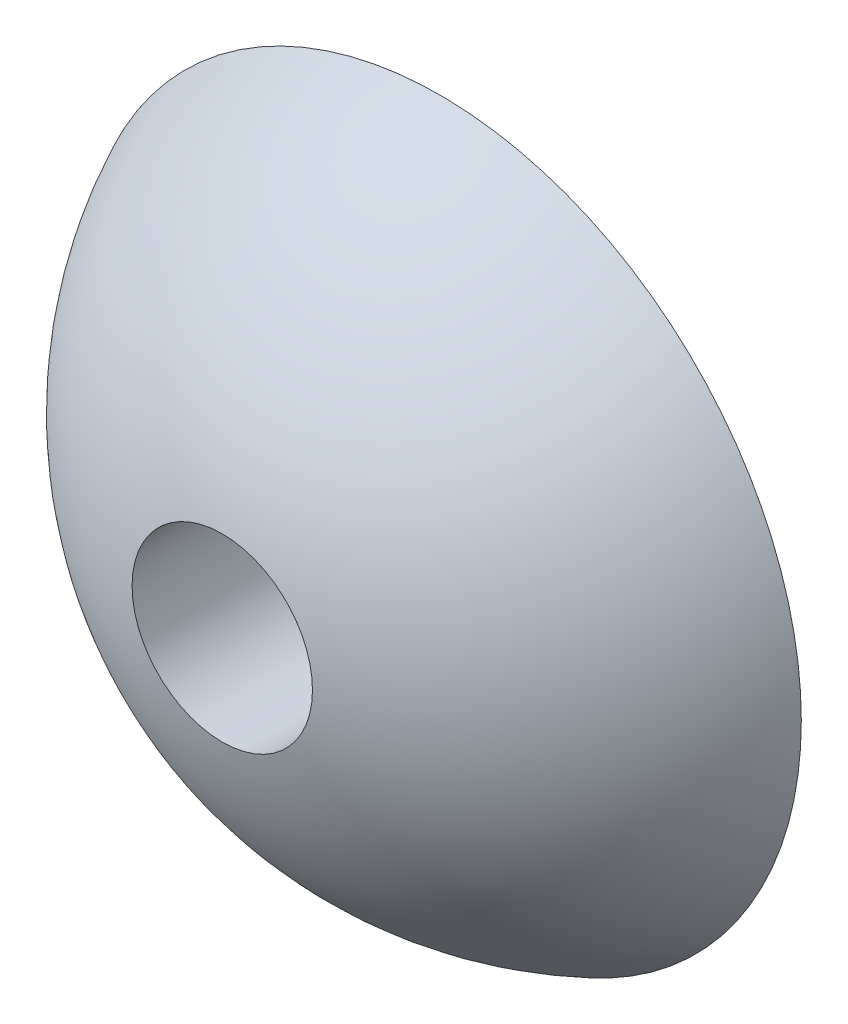
ISO-10303-21;
HEADER;
FILE_DESCRIPTION(('STEP AP214'),'2;1');
FILE_NAME('part.step','',(''),(''),'','','');
FILE_SCHEMA(('AUTOMOTIVE_DESIGN { 1 0 10303 214 1 1 1 1 }'));
ENDSEC;
DATA;
#1=APPLICATION_CONTEXT('core data for automotive mechanical design processes');
#2=APPLICATION_PROTOCOL_DEFINITION('international standard','automotive_design',2000,#1);
#3=PRODUCT_CONTEXT('',#1,'mechanical');
#4=PRODUCT('Part','Part','',(#3));
#5=PRODUCT_RELATED_PRODUCT_CATEGORY('part','',(#4));
#6=PRODUCT_DEFINITION_FORMATION('','',#4);
#7=PRODUCT_DEFINITION_CONTEXT('part definition',#1,'design');
#8=PRODUCT_DEFINITION('design','',#6,#7);
#9=PRODUCT_DEFINITION_SHAPE('','',#8);
#10=(LENGTH_UNIT() NAMED_UNIT(*) SI_UNIT(.MILLI.,.METRE.));
#11=(NAMED_UNIT(*) PLANE_ANGLE_UNIT() SI_UNIT($,.RADIAN.));
#12=(NAMED_UNIT(*) SI_UNIT($,.STERADIAN.) SOLID_ANGLE_UNIT());
#13=UNCERTAINTY_MEASURE_WITH_UNIT(LENGTH_MEASURE(1.E-05),#10,'distance_accuracy_value','');
#14=(GEOMETRIC_REPRESENTATION_CONTEXT(3) GLOBAL_UNCERTAINTY_ASSIGNED_CONTEXT((#13)) GLOBAL_UNIT_ASSIGNED_CONTEXT((#10,
#11,#12)) REPRESENTATION_CONTEXT('',''));
#15=CARTESIAN_POINT('',(0.,0.,0.));
#16=DIRECTION('',(0.,0.,1.));
#17=DIRECTION('',(1.,0.,0.));
#18=AXIS2_PLACEMENT_3D('',#15,#16,#17);
#19=CARTESIAN_POINT('',(35.,-7.,15.));
#20=DIRECTION('',(0.,0.,1.));
#21=DIRECTION('',(1.,0.,0.));
#22=AXIS2_PLACEMENT_3D('',#19,#20,#21);
#23=PLANE('',#22);
#24=CARTESIAN_POINT('',(35.,0.,15.));
#25=DIRECTION('',(0.,0.,1.));
#26=DIRECTION('',(1.,0.,0.));
#27=AXIS2_PLACEMENT_3D('',#24,#25,#26);
#28=CIRCLE('',#27,7.9);
#29=CARTESIAN_POINT('',(42.9,0.,15.));
#30=VERTEX_POINT('',#29);
#31=EDGE_CURVE('E41',#30,#30,#28,.T.);
#32=ORIENTED_EDGE('',*,*,#31,.T.);
#33=EDGE_LOOP('',(#32));
#34=FACE_BOUND('',#33,.T.);
#35=CARTESIAN_POINT('',(35.,0.,15.));
#36=DIRECTION('',(0.,0.,1.));
#37=DIRECTION('',(1.,0.,0.));
#38=AXIS2_PLACEMENT_3D('',#35,#36,#37);
#39=CIRCLE('',#38,31.6227766016838);
#40=CARTESIAN_POINT('',(66.6227766016838,0.,15.));
#41=VERTEX_POINT('',#40);
#42=EDGE_CURVE('E37',#41,#41,#39,.T.);
#43=ORIENTED_EDGE('',*,*,#42,.F.);
#44=EDGE_LOOP('',(#43));
#45=FACE_BOUND('',#44,.T.);
#46=ADVANCED_FACE('F33',(#34,#45),#23,.F.);
#47=CARTESIAN_POINT('',(35.,0.,15.));
#48=DIRECTION('',(0.,0.,1.));
#49=DIRECTION('',(1.,0.,0.));
#50=AXIS2_PLACEMENT_3D('',#47,#48,#49);
#51=CYLINDRICAL_SURFACE('',#50,7.9);
#52=ORIENTED_EDGE('',*,*,#31,.F.);
#53=EDGE_LOOP('',(#52));
#54=FACE_BOUND('',#53,.T.);
#55=CARTESIAN_POINT('',(35.,0.,34.0967740409558));
#56=DIRECTION('',(0.,0.,-1.));
#57=DIRECTION('',(-1.,0.,0.));
#58=AXIS2_PLACEMENT_3D('',#55,#56,#57);
#59=CIRCLE('',#58,7.9);
#60=CARTESIAN_POINT('',(27.1,0.,34.0967740409558));
#61=VERTEX_POINT('',#60);
#62=EDGE_CURVE('E10',#61,#61,#59,.T.);
#63=ORIENTED_EDGE('',*,*,#62,.F.);
#64=EDGE_LOOP('',(#63));
#65=FACE_BOUND('',#64,.T.);
#66=ADVANCED_FACE('F53',(#54,#65),#51,.F.);
#67=CARTESIAN_POINT('',(35.,0.,0.));
#68=DIRECTION('',(-1.,0.,0.));
#69=DIRECTION('',(0.,1.,0.));
#70=AXIS2_PLACEMENT_3D('',#67,#68,#69);
#71=SPHERICAL_SURFACE('',#70,35.);
#72=CARTESIAN_POINT('',(35.,0.,0.));
#73=DIRECTION('',(0.,0.,1.));
#74=DIRECTION('',(1.,0.,0.));
#75=AXIS2_PLACEMENT_3D('',#72,#73,#74);
#76=SPHERICAL_SURFACE('',#75,35.);
#77=ORIENTED_EDGE('',*,*,#42,.T.);
#78=EDGE_LOOP('',(#77));
#79=FACE_BOUND('',#78,.T.);
#80=ORIENTED_EDGE('',*,*,#62,.T.);
#81=EDGE_LOOP('',(#80));
#82=FACE_BOUND('',#81,.T.);
#83=ADVANCED_FACE('F35',(#79,#82),#76,.T.);
#84=CLOSED_SHELL('',(#46,#66,#83));
#85=MANIFOLD_SOLID_BREP('B2',#84);
#86=ADVANCED_BREP_SHAPE_REPRESENTATION('',(#18,#85),#14);
#87=SHAPE_DEFINITION_REPRESENTATION(#9,#86);
ENDSEC;
END-ISO-10303-21;
